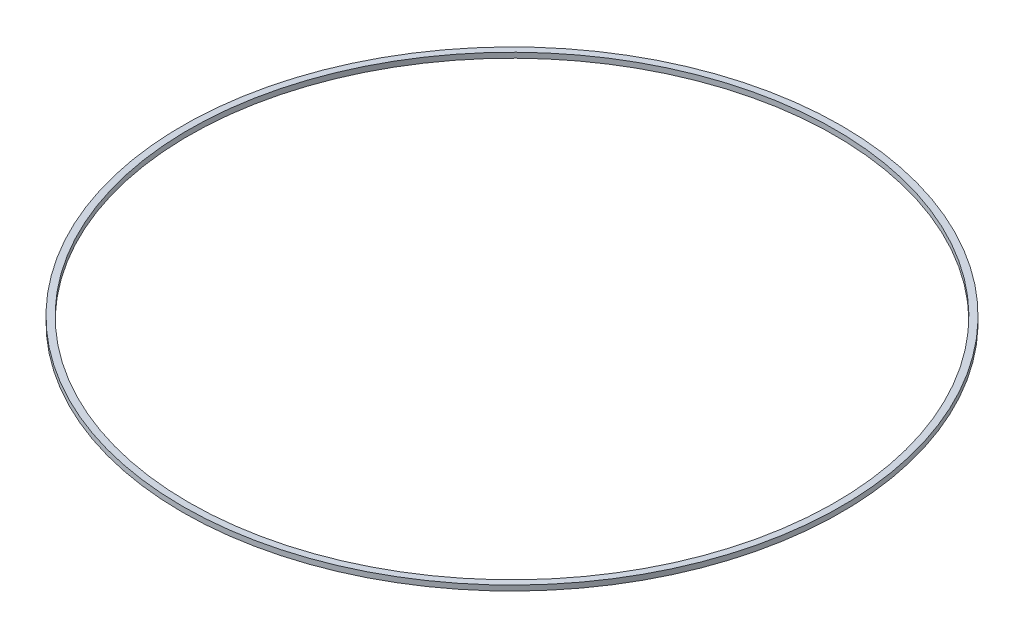
ISO-10303-21;
HEADER;
FILE_DESCRIPTION(('STEP AP214'),'2;1');
FILE_NAME('part.step','',(''),(''),'','','');
FILE_SCHEMA(('AUTOMOTIVE_DESIGN { 1 0 10303 214 1 1 1 1 }'));
ENDSEC;
DATA;
#1=APPLICATION_CONTEXT('core data for automotive mechanical design processes');
#2=APPLICATION_PROTOCOL_DEFINITION('international standard','automotive_design',2000,#1);
#3=PRODUCT_CONTEXT('',#1,'mechanical');
#4=PRODUCT('Part','Part','',(#3));
#5=PRODUCT_RELATED_PRODUCT_CATEGORY('part','',(#4));
#6=PRODUCT_DEFINITION_FORMATION('','',#4);
#7=PRODUCT_DEFINITION_CONTEXT('part definition',#1,'design');
#8=PRODUCT_DEFINITION('design','',#6,#7);
#9=PRODUCT_DEFINITION_SHAPE('','',#8);
#10=(LENGTH_UNIT() NAMED_UNIT(*) SI_UNIT(.MILLI.,.METRE.));
#11=(NAMED_UNIT(*) PLANE_ANGLE_UNIT() SI_UNIT($,.RADIAN.));
#12=(NAMED_UNIT(*) SI_UNIT($,.STERADIAN.) SOLID_ANGLE_UNIT());
#13=UNCERTAINTY_MEASURE_WITH_UNIT(LENGTH_MEASURE(1.E-05),#10,'distance_accuracy_value','');
#14=(GEOMETRIC_REPRESENTATION_CONTEXT(3) GLOBAL_UNCERTAINTY_ASSIGNED_CONTEXT((#13)) GLOBAL_UNIT_ASSIGNED_CONTEXT((#10,
#11,#12)) REPRESENTATION_CONTEXT('',''));
#15=CARTESIAN_POINT('',(0.,0.,0.));
#16=DIRECTION('',(0.,0.,1.));
#17=DIRECTION('',(1.,0.,0.));
#18=AXIS2_PLACEMENT_3D('',#15,#16,#17);
#19=CARTESIAN_POINT('',(0.,0.4,0.));
#20=DIRECTION('',(0.,1.,0.));
#21=DIRECTION('',(0.,0.,1.));
#22=AXIS2_PLACEMENT_3D('',#19,#20,#21);
#23=PLANE('',#22);
#24=CARTESIAN_POINT('',(0.,0.4,0.));
#25=DIRECTION('',(0.,1.,0.));
#26=DIRECTION('',(0.,0.,1.));
#27=AXIS2_PLACEMENT_3D('',#24,#25,#26);
#28=CIRCLE('',#27,25.4);
#29=CARTESIAN_POINT('',(0.,0.4,25.4));
#30=VERTEX_POINT('',#29);
#31=EDGE_CURVE('E10',#30,#30,#28,.T.);
#32=ORIENTED_EDGE('',*,*,#31,.T.);
#33=EDGE_LOOP('',(#32));
#34=FACE_BOUND('',#33,.T.);
#35=CARTESIAN_POINT('',(0.,0.4,0.));
#36=DIRECTION('',(0.,1.,0.));
#37=DIRECTION('',(0.,0.,1.));
#38=AXIS2_PLACEMENT_3D('',#35,#36,#37);
#39=CIRCLE('',#38,24.9);
#40=CARTESIAN_POINT('',(0.,0.4,24.9));
#41=VERTEX_POINT('',#40);
#42=EDGE_CURVE('E42',#41,#41,#39,.T.);
#43=ORIENTED_EDGE('',*,*,#42,.F.);
#44=EDGE_LOOP('',(#43));
#45=FACE_BOUND('',#44,.T.);
#46=ADVANCED_FACE('F31',(#34,#45),#23,.T.);
#47=CARTESIAN_POINT('',(0.,0.,0.));
#48=DIRECTION('',(0.,1.,0.));
#49=DIRECTION('',(0.,0.,1.));
#50=AXIS2_PLACEMENT_3D('',#47,#48,#49);
#51=PLANE('',#50);
#52=CARTESIAN_POINT('',(0.,0.,0.));
#53=DIRECTION('',(0.,1.,0.));
#54=DIRECTION('',(0.,0.,1.));
#55=AXIS2_PLACEMENT_3D('',#52,#53,#54);
#56=CIRCLE('',#55,25.4);
#57=CARTESIAN_POINT('',(0.,0.,25.4));
#58=VERTEX_POINT('',#57);
#59=EDGE_CURVE('E35',#58,#58,#56,.T.);
#60=ORIENTED_EDGE('',*,*,#59,.F.);
#61=EDGE_LOOP('',(#60));
#62=FACE_BOUND('',#61,.T.);
#63=CARTESIAN_POINT('',(0.,0.,0.));
#64=DIRECTION('',(0.,1.,0.));
#65=DIRECTION('',(0.,0.,1.));
#66=AXIS2_PLACEMENT_3D('',#63,#64,#65);
#67=CIRCLE('',#66,24.9);
#68=CARTESIAN_POINT('',(0.,0.,24.9));
#69=VERTEX_POINT('',#68);
#70=EDGE_CURVE('E44',#69,#69,#67,.T.);
#71=ORIENTED_EDGE('',*,*,#70,.T.);
#72=EDGE_LOOP('',(#71));
#73=FACE_BOUND('',#72,.T.);
#74=ADVANCED_FACE('F54',(#62,#73),#51,.F.);
#75=CARTESIAN_POINT('',(0.,0.4,0.));
#76=DIRECTION('',(0.,-1.,0.));
#77=DIRECTION('',(0.,0.,-1.));
#78=AXIS2_PLACEMENT_3D('',#75,#76,#77);
#79=CYLINDRICAL_SURFACE('',#78,25.4);
#80=ORIENTED_EDGE('',*,*,#31,.F.);
#81=EDGE_LOOP('',(#80));
#82=FACE_BOUND('',#81,.T.);
#83=ORIENTED_EDGE('',*,*,#59,.T.);
#84=EDGE_LOOP('',(#83));
#85=FACE_BOUND('',#84,.T.);
#86=ADVANCED_FACE('F33',(#82,#85),#79,.T.);
#87=CARTESIAN_POINT('',(0.,0.4,0.));
#88=DIRECTION('',(0.,-1.,0.));
#89=DIRECTION('',(0.,0.,-1.));
#90=AXIS2_PLACEMENT_3D('',#87,#88,#89);
#91=CYLINDRICAL_SURFACE('',#90,24.9);
#92=ORIENTED_EDGE('',*,*,#42,.T.);
#93=EDGE_LOOP('',(#92));
#94=FACE_BOUND('',#93,.T.);
#95=ORIENTED_EDGE('',*,*,#70,.F.);
#96=EDGE_LOOP('',(#95));
#97=FACE_BOUND('',#96,.T.);
#98=ADVANCED_FACE('F50',(#94,#97),#91,.F.);
#99=CLOSED_SHELL('',(#46,#74,#86,#98));
#100=MANIFOLD_SOLID_BREP('B2',#99);
#101=ADVANCED_BREP_SHAPE_REPRESENTATION('',(#18,#100),#14);
#102=SHAPE_DEFINITION_REPRESENTATION(#9,#101);
ENDSEC;
END-ISO-10303-21;
